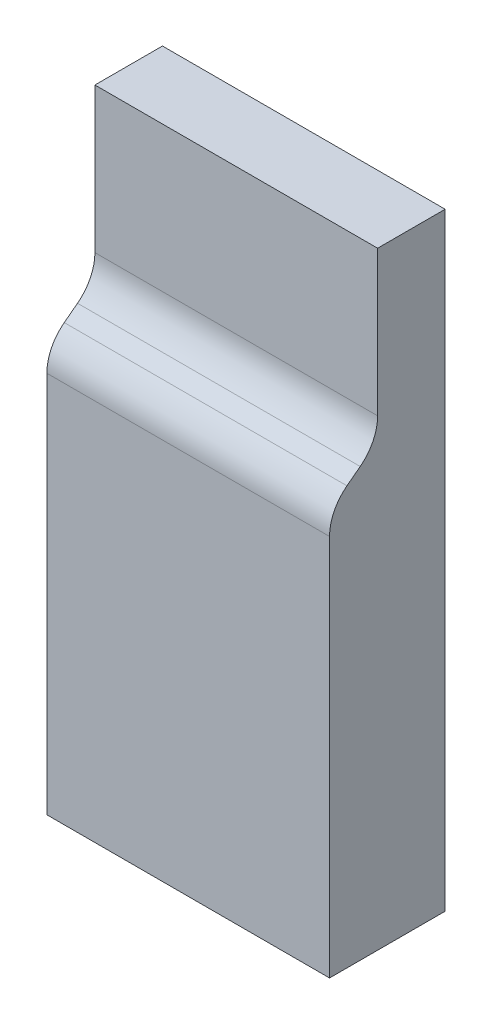
ISO-10303-21;
HEADER;
FILE_DESCRIPTION(('STEP AP214'),'2;1');
FILE_NAME('part.step','',(''),(''),'','','');
FILE_SCHEMA(('AUTOMOTIVE_DESIGN { 1 0 10303 214 1 1 1 1 }'));
ENDSEC;
DATA;
#1=APPLICATION_CONTEXT('core data for automotive mechanical design processes');
#2=APPLICATION_PROTOCOL_DEFINITION('international standard','automotive_design',2000,#1);
#3=PRODUCT_CONTEXT('',#1,'mechanical');
#4=PRODUCT('Part','Part','',(#3));
#5=PRODUCT_RELATED_PRODUCT_CATEGORY('part','',(#4));
#6=PRODUCT_DEFINITION_FORMATION('','',#4);
#7=PRODUCT_DEFINITION_CONTEXT('part definition',#1,'design');
#8=PRODUCT_DEFINITION('design','',#6,#7);
#9=PRODUCT_DEFINITION_SHAPE('','',#8);
#10=(LENGTH_UNIT() NAMED_UNIT(*) SI_UNIT(.MILLI.,.METRE.));
#11=(NAMED_UNIT(*) PLANE_ANGLE_UNIT() SI_UNIT($,.RADIAN.));
#12=(NAMED_UNIT(*) SI_UNIT($,.STERADIAN.) SOLID_ANGLE_UNIT());
#13=UNCERTAINTY_MEASURE_WITH_UNIT(LENGTH_MEASURE(1.E-05),#10,'distance_accuracy_value','');
#14=(GEOMETRIC_REPRESENTATION_CONTEXT(3) GLOBAL_UNCERTAINTY_ASSIGNED_CONTEXT((#13)) GLOBAL_UNIT_ASSIGNED_CONTEXT((#10,
#11,#12)) REPRESENTATION_CONTEXT('',''));
#15=CARTESIAN_POINT('',(0.,0.,0.));
#16=DIRECTION('',(0.,0.,1.));
#17=DIRECTION('',(1.,0.,0.));
#18=AXIS2_PLACEMENT_3D('',#15,#16,#17);
#19=CARTESIAN_POINT('',(-73.7990997532734,55.1058591516096,155.77110978578));
#20=DIRECTION('',(0.,-1.,0.));
#21=DIRECTION('',(0.,0.,-1.));
#22=AXIS2_PLACEMENT_3D('',#19,#20,#21);
#23=PLANE('',#22);
#24=DIRECTION('',(1.,0.,0.));
#25=VECTOR('',#24,1.);
#26=CARTESIAN_POINT('',(-119.50629885397,55.1058591516096,13.3828387257561));
#27=LINE('',#26,#25);
#28=CARTESIAN_POINT('',(-73.7990997532734,55.1058591516096,13.3828387257561));
#29=VERTEX_POINT('',#28);
#30=CARTESIAN_POINT('',(-17.7814574786055,55.1058591516096,13.3828387257561));
#31=VERTEX_POINT('',#30);
#32=EDGE_CURVE('E127',#29,#31,#27,.T.);
#33=ORIENTED_EDGE('',*,*,#32,.T.);
#34=DIRECTION('',(0.,0.,-1.));
#35=VECTOR('',#34,1.);
#36=CARTESIAN_POINT('',(-17.7814574786055,55.1058591516096,155.77110978578));
#37=LINE('',#36,#35);
#38=CARTESIAN_POINT('',(-17.7814574786055,55.1058591516096,0.));
#39=VERTEX_POINT('',#38);
#40=EDGE_CURVE('E151',#31,#39,#37,.T.);
#41=ORIENTED_EDGE('',*,*,#40,.T.);
#42=DIRECTION('',(-1.,0.,0.));
#43=VECTOR('',#42,1.);
#44=CARTESIAN_POINT('',(-73.7990997532734,55.1058591516096,0.));
#45=LINE('',#44,#43);
#46=CARTESIAN_POINT('',(-73.7990997532734,55.1058591516096,0.));
#47=VERTEX_POINT('',#46);
#48=EDGE_CURVE('E146',#39,#47,#45,.T.);
#49=ORIENTED_EDGE('',*,*,#48,.T.);
#50=DIRECTION('',(0.,0.,-1.));
#51=VECTOR('',#50,1.);
#52=CARTESIAN_POINT('',(-73.7990997532734,55.1058591516096,155.77110978578));
#53=LINE('',#52,#51);
#54=EDGE_CURVE('E149',#29,#47,#53,.T.);
#55=ORIENTED_EDGE('',*,*,#54,.F.);
#56=EDGE_LOOP('',(#33,#41,#49,#55));
#57=FACE_BOUND('',#56,.T.);
#58=ADVANCED_FACE('F32',(#57),#23,.F.);
#59=CARTESIAN_POINT('',(-17.7814574786055,-65.370995682656,155.77110978578));
#60=DIRECTION('',(-1.,0.,0.));
#61=DIRECTION('',(0.,0.,1.));
#62=AXIS2_PLACEMENT_3D('',#59,#60,#61);
#63=PLANE('',#62);
#64=CARTESIAN_POINT('',(-17.7814574786055,10.4021409099387,14.1448387257561));
#65=DIRECTION('',(1.,0.,0.));
#66=DIRECTION('',(0.,0.,-1.));
#67=AXIS2_PLACEMENT_3D('',#64,#65,#66);
#68=CIRCLE('',#67,8.763);
#69=CARTESIAN_POINT('',(-17.7814574786055,17.3699490683026,19.4589537478683));
#70=VERTEX_POINT('',#69);
#71=CARTESIAN_POINT('',(-17.7814574786055,10.4021409099387,22.9078387257561));
#72=VERTEX_POINT('',#71);
#73=EDGE_CURVE('E112',#70,#72,#68,.T.);
#74=ORIENTED_EDGE('',*,*,#73,.T.);
#75=DIRECTION('',(0.,-1.,0.));
#76=VECTOR('',#75,1.);
#77=CARTESIAN_POINT('',(-17.7814574786055,-65.370995682656,22.9078387257561));
#78=LINE('',#77,#76);
#79=CARTESIAN_POINT('',(-17.7814574786055,-65.370995682656,22.9078387257561));
#80=VERTEX_POINT('',#79);
#81=EDGE_CURVE('E57',#72,#80,#78,.T.);
#82=ORIENTED_EDGE('',*,*,#81,.T.);
#83=DIRECTION('',(0.,0.,-1.));
#84=VECTOR('',#83,1.);
#85=CARTESIAN_POINT('',(-17.7814574786055,-65.370995682656,155.77110978578));
#86=LINE('',#85,#84);
#87=CARTESIAN_POINT('',(-17.7814574786055,-65.370995682656,0.));
#88=VERTEX_POINT('',#87);
#89=EDGE_CURVE('E152',#80,#88,#86,.T.);
#90=ORIENTED_EDGE('',*,*,#89,.T.);
#91=DIRECTION('',(0.,1.,0.));
#92=VECTOR('',#91,1.);
#93=CARTESIAN_POINT('',(-17.7814574786055,-65.370995682656,0.));
#94=LINE('',#93,#92);
#95=EDGE_CURVE('E143',#88,#39,#94,.T.);
#96=ORIENTED_EDGE('',*,*,#95,.T.);
#97=ORIENTED_EDGE('',*,*,#40,.F.);
#98=DIRECTION('',(0.,-1.,0.));
#99=VECTOR('',#98,1.);
#100=CARTESIAN_POINT('',(-17.7814574786055,0.,13.3828387257561));
#101=LINE('',#100,#99);
#102=CARTESIAN_POINT('',(-17.7814574786055,26.3414580070616,13.3828387257561));
#103=VERTEX_POINT('',#102);
#104=EDGE_CURVE('E110',#31,#103,#101,.T.);
#105=ORIENTED_EDGE('',*,*,#104,.T.);
#106=CARTESIAN_POINT('',(-17.7814574786055,26.3414580070615,22.1458387257561));
#107=DIRECTION('',(1.,0.,0.));
#108=DIRECTION('',(0.,0.,-1.));
#109=AXIS2_PLACEMENT_3D('',#106,#107,#108);
#110=CIRCLE('',#109,8.763);
#111=CARTESIAN_POINT('',(-17.7814574786055,19.3736498486976,16.831723703644));
#112=VERTEX_POINT('',#111);
#113=EDGE_CURVE('E119',#112,#103,#110,.T.);
#114=ORIENTED_EDGE('',*,*,#113,.F.);
#115=DIRECTION('',(0.,0.60642645465162,-0.795139582148108));
#116=VECTOR('',#115,1.);
#117=CARTESIAN_POINT('',(-17.7814574786055,20.3650818816071,15.5317691150389));
#118=LINE('',#117,#116);
#119=EDGE_CURVE('E105',#70,#112,#118,.T.);
#120=ORIENTED_EDGE('',*,*,#119,.F.);
#121=EDGE_LOOP('',(#74,#82,#90,#96,#97,#105,#114,#120));
#122=FACE_BOUND('',#121,.T.);
#123=ADVANCED_FACE('F116',(#122),#63,.F.);
#124=CARTESIAN_POINT('',(-73.7990997532734,-65.370995682656,155.77110978578));
#125=DIRECTION('',(1.,0.,0.));
#126=DIRECTION('',(0.,0.,-1.));
#127=AXIS2_PLACEMENT_3D('',#124,#125,#126);
#128=PLANE('',#127);
#129=CARTESIAN_POINT('',(-73.7990997532734,10.4021409099387,14.1448387257561));
#130=DIRECTION('',(1.,0.,0.));
#131=DIRECTION('',(0.,0.,-1.));
#132=AXIS2_PLACEMENT_3D('',#129,#130,#131);
#133=CIRCLE('',#132,8.763);
#134=CARTESIAN_POINT('',(-73.7990997532734,10.4021409099387,22.9078387257561));
#135=VERTEX_POINT('',#134);
#136=CARTESIAN_POINT('',(-73.7990997532734,17.3699490683026,19.4589537478683));
#137=VERTEX_POINT('',#136);
#138=EDGE_CURVE('E49',#135,#137,#133,.F.);
#139=ORIENTED_EDGE('',*,*,#138,.T.);
#140=DIRECTION('',(0.,-0.60642645465162,0.795139582148108));
#141=VECTOR('',#140,1.);
#142=CARTESIAN_POINT('',(-73.7990997532734,20.3650818816071,15.5317691150389));
#143=LINE('',#142,#141);
#144=CARTESIAN_POINT('',(-73.7990997532734,19.3736498486976,16.831723703644));
#145=VERTEX_POINT('',#144);
#146=EDGE_CURVE('E108',#145,#137,#143,.T.);
#147=ORIENTED_EDGE('',*,*,#146,.F.);
#148=CARTESIAN_POINT('',(-73.7990997532734,26.3414580070615,22.1458387257561));
#149=DIRECTION('',(1.,0.,0.));
#150=DIRECTION('',(0.,0.,-1.));
#151=AXIS2_PLACEMENT_3D('',#148,#149,#150);
#152=CIRCLE('',#151,8.763);
#153=CARTESIAN_POINT('',(-73.7990997532734,26.3414580070615,13.3828387257561));
#154=VERTEX_POINT('',#153);
#155=EDGE_CURVE('E126',#154,#145,#152,.F.);
#156=ORIENTED_EDGE('',*,*,#155,.F.);
#157=DIRECTION('',(0.,1.,0.));
#158=VECTOR('',#157,1.);
#159=CARTESIAN_POINT('',(-73.7990997532734,0.,13.3828387257561));
#160=LINE('',#159,#158);
#161=EDGE_CURVE('E167',#154,#29,#160,.T.);
#162=ORIENTED_EDGE('',*,*,#161,.T.);
#163=ORIENTED_EDGE('',*,*,#54,.T.);
#164=DIRECTION('',(0.,-1.,0.));
#165=VECTOR('',#164,1.);
#166=CARTESIAN_POINT('',(-73.7990997532734,-65.370995682656,0.));
#167=LINE('',#166,#165);
#168=CARTESIAN_POINT('',(-73.7990997532734,-65.370995682656,0.));
#169=VERTEX_POINT('',#168);
#170=EDGE_CURVE('E134',#47,#169,#167,.T.);
#171=ORIENTED_EDGE('',*,*,#170,.T.);
#172=DIRECTION('',(0.,0.,-1.));
#173=VECTOR('',#172,1.);
#174=CARTESIAN_POINT('',(-73.7990997532734,-65.370995682656,155.77110978578));
#175=LINE('',#174,#173);
#176=CARTESIAN_POINT('',(-73.7990997532734,-65.370995682656,22.9078387257561));
#177=VERTEX_POINT('',#176);
#178=EDGE_CURVE('E36',#177,#169,#175,.T.);
#179=ORIENTED_EDGE('',*,*,#178,.F.);
#180=DIRECTION('',(0.,1.,0.));
#181=VECTOR('',#180,1.);
#182=CARTESIAN_POINT('',(-73.7990997532734,-65.370995682656,22.9078387257561));
#183=LINE('',#182,#181);
#184=EDGE_CURVE('E11',#177,#135,#183,.T.);
#185=ORIENTED_EDGE('',*,*,#184,.T.);
#186=EDGE_LOOP('',(#139,#147,#156,#162,#163,#171,#179,#185));
#187=FACE_BOUND('',#186,.T.);
#188=ADVANCED_FACE('F34',(#187),#128,.F.);
#189=CARTESIAN_POINT('',(-57.624133753255,-6.29632368199578,22.9078387257561));
#190=DIRECTION('',(0.,0.,-1.));
#191=DIRECTION('',(-1.,0.,0.));
#192=AXIS2_PLACEMENT_3D('',#189,#190,#191);
#193=PLANE('',#192);
#194=DIRECTION('',(1.,0.,0.));
#195=VECTOR('',#194,1.);
#196=CARTESIAN_POINT('',(-119.50629885397,10.4021409099387,22.9078387257561));
#197=LINE('',#196,#195);
#198=EDGE_CURVE('E114',#135,#72,#197,.T.);
#199=ORIENTED_EDGE('',*,*,#198,.F.);
#200=ORIENTED_EDGE('',*,*,#184,.F.);
#201=DIRECTION('',(-1.,0.,0.));
#202=VECTOR('',#201,1.);
#203=CARTESIAN_POINT('',(-73.7990997532734,-65.370995682656,22.9078387257561));
#204=LINE('',#203,#202);
#205=EDGE_CURVE('E41',#80,#177,#204,.T.);
#206=ORIENTED_EDGE('',*,*,#205,.F.);
#207=ORIENTED_EDGE('',*,*,#81,.F.);
#208=EDGE_LOOP('',(#199,#200,#206,#207));
#209=FACE_BOUND('',#208,.T.);
#210=ADVANCED_FACE('F178',(#209),#193,.F.);
#211=CARTESIAN_POINT('',(0.,0.,0.));
#212=DIRECTION('',(0.,0.,-1.));
#213=DIRECTION('',(-1.,0.,0.));
#214=AXIS2_PLACEMENT_3D('',#211,#212,#213);
#215=PLANE('',#214);
#216=ORIENTED_EDGE('',*,*,#170,.F.);
#217=ORIENTED_EDGE('',*,*,#48,.F.);
#218=ORIENTED_EDGE('',*,*,#95,.F.);
#219=DIRECTION('',(1.,0.,0.));
#220=VECTOR('',#219,1.);
#221=CARTESIAN_POINT('',(-73.7990997532734,-65.370995682656,0.));
#222=LINE('',#221,#220);
#223=EDGE_CURVE('E140',#169,#88,#222,.T.);
#224=ORIENTED_EDGE('',*,*,#223,.F.);
#225=EDGE_LOOP('',(#216,#217,#218,#224));
#226=FACE_BOUND('',#225,.T.);
#227=ADVANCED_FACE('F162',(#226),#215,.T.);
#228=CARTESIAN_POINT('',(-73.7990997532734,-65.370995682656,155.77110978578));
#229=DIRECTION('',(0.,1.,0.));
#230=DIRECTION('',(0.,0.,1.));
#231=AXIS2_PLACEMENT_3D('',#228,#229,#230);
#232=PLANE('',#231);
#233=ORIENTED_EDGE('',*,*,#89,.F.);
#234=ORIENTED_EDGE('',*,*,#205,.T.);
#235=ORIENTED_EDGE('',*,*,#178,.T.);
#236=ORIENTED_EDGE('',*,*,#223,.T.);
#237=EDGE_LOOP('',(#233,#234,#235,#236));
#238=FACE_BOUND('',#237,.T.);
#239=ADVANCED_FACE('F157',(#238),#232,.F.);
#240=CARTESIAN_POINT('',(-119.50629885397,10.4021409099387,14.1448387257561));
#241=DIRECTION('',(1.,0.,0.));
#242=DIRECTION('',(0.,0.,-1.));
#243=AXIS2_PLACEMENT_3D('',#240,#241,#242);
#244=CYLINDRICAL_SURFACE('',#243,8.763);
#245=ORIENTED_EDGE('',*,*,#198,.T.);
#246=ORIENTED_EDGE('',*,*,#73,.F.);
#247=DIRECTION('',(1.,0.,0.));
#248=VECTOR('',#247,1.);
#249=CARTESIAN_POINT('',(-119.50629885397,17.3699490683026,19.4589537478683));
#250=LINE('',#249,#248);
#251=EDGE_CURVE('E100',#137,#70,#250,.T.);
#252=ORIENTED_EDGE('',*,*,#251,.F.);
#253=ORIENTED_EDGE('',*,*,#138,.F.);
#254=EDGE_LOOP('',(#245,#246,#252,#253));
#255=FACE_BOUND('',#254,.T.);
#256=ADVANCED_FACE('F113',(#255),#244,.T.);
#257=CARTESIAN_POINT('',(-119.50629885397,0.,13.3828387257561));
#258=DIRECTION('',(0.,0.,1.));
#259=DIRECTION('',(1.,0.,0.));
#260=AXIS2_PLACEMENT_3D('',#257,#258,#259);
#261=PLANE('',#260);
#262=DIRECTION('',(1.,0.,0.));
#263=VECTOR('',#262,1.);
#264=CARTESIAN_POINT('',(-119.50629885397,26.3414580070616,13.3828387257561));
#265=LINE('',#264,#263);
#266=EDGE_CURVE('E130',#154,#103,#265,.T.);
#267=ORIENTED_EDGE('',*,*,#266,.T.);
#268=ORIENTED_EDGE('',*,*,#104,.F.);
#269=ORIENTED_EDGE('',*,*,#32,.F.);
#270=ORIENTED_EDGE('',*,*,#161,.F.);
#271=EDGE_LOOP('',(#267,#268,#269,#270));
#272=FACE_BOUND('',#271,.T.);
#273=ADVANCED_FACE('F171',(#272),#261,.T.);
#274=CARTESIAN_POINT('',(-119.50629885397,26.3414580070615,22.1458387257561));
#275=DIRECTION('',(1.,0.,0.));
#276=DIRECTION('',(0.,0.,-1.));
#277=AXIS2_PLACEMENT_3D('',#274,#275,#276);
#278=CYLINDRICAL_SURFACE('',#277,8.763);
#279=ORIENTED_EDGE('',*,*,#155,.T.);
#280=DIRECTION('',(1.,0.,0.));
#281=VECTOR('',#280,1.);
#282=CARTESIAN_POINT('',(-119.50629885397,19.3736498486976,16.831723703644));
#283=LINE('',#282,#281);
#284=EDGE_CURVE('E109',#145,#112,#283,.T.);
#285=ORIENTED_EDGE('',*,*,#284,.T.);
#286=ORIENTED_EDGE('',*,*,#113,.T.);
#287=ORIENTED_EDGE('',*,*,#266,.F.);
#288=EDGE_LOOP('',(#279,#285,#286,#287));
#289=FACE_BOUND('',#288,.T.);
#290=ADVANCED_FACE('F174',(#289),#278,.F.);
#291=CARTESIAN_POINT('',(-119.50629885397,20.3650818816071,15.5317691150389));
#292=DIRECTION('',(0.,-0.795139582148108,-0.60642645465162));
#293=DIRECTION('',(0.,0.60642645465162,-0.795139582148108));
#294=AXIS2_PLACEMENT_3D('',#291,#292,#293);
#295=PLANE('',#294);
#296=ORIENTED_EDGE('',*,*,#146,.T.);
#297=ORIENTED_EDGE('',*,*,#251,.T.);
#298=ORIENTED_EDGE('',*,*,#119,.T.);
#299=ORIENTED_EDGE('',*,*,#284,.F.);
#300=EDGE_LOOP('',(#296,#297,#298,#299));
#301=FACE_BOUND('',#300,.T.);
#302=ADVANCED_FACE('F102',(#301),#295,.F.);
#303=CLOSED_SHELL('',(#58,#123,#188,#210,#227,#239,#256,#273,#290,#302));
#304=MANIFOLD_SOLID_BREP('B2',#303);
#305=ADVANCED_BREP_SHAPE_REPRESENTATION('',(#18,#304),#14);
#306=SHAPE_DEFINITION_REPRESENTATION(#9,#305);
ENDSEC;
END-ISO-10303-21;
